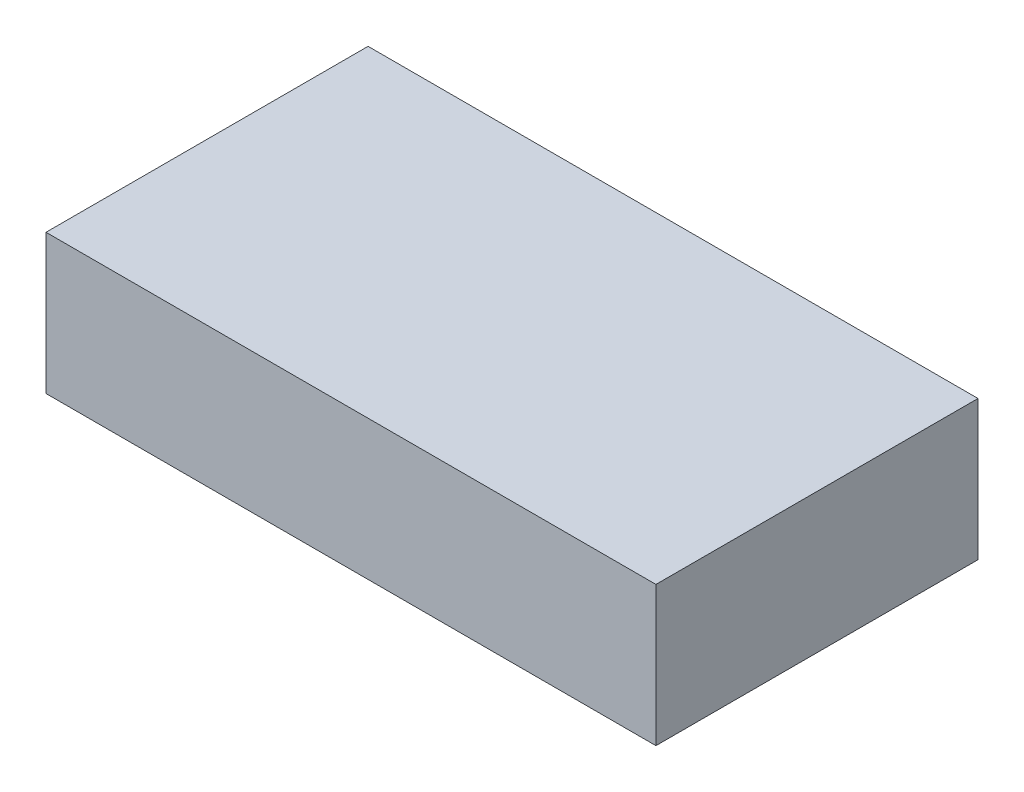
ISO-10303-21;
HEADER;
FILE_DESCRIPTION(('STEP AP214'),'2;1');
FILE_NAME('part.step','',(''),(''),'','','');
FILE_SCHEMA(('AUTOMOTIVE_DESIGN { 1 0 10303 214 1 1 1 1 }'));
ENDSEC;
DATA;
#1=APPLICATION_CONTEXT('core data for automotive mechanical design processes');
#2=APPLICATION_PROTOCOL_DEFINITION('international standard','automotive_design',2000,#1);
#3=PRODUCT_CONTEXT('',#1,'mechanical');
#4=PRODUCT('Part','Part','',(#3));
#5=PRODUCT_RELATED_PRODUCT_CATEGORY('part','',(#4));
#6=PRODUCT_DEFINITION_FORMATION('','',#4);
#7=PRODUCT_DEFINITION_CONTEXT('part definition',#1,'design');
#8=PRODUCT_DEFINITION('design','',#6,#7);
#9=PRODUCT_DEFINITION_SHAPE('','',#8);
#10=(LENGTH_UNIT() NAMED_UNIT(*) SI_UNIT(.MILLI.,.METRE.));
#11=(NAMED_UNIT(*) PLANE_ANGLE_UNIT() SI_UNIT($,.RADIAN.));
#12=(NAMED_UNIT(*) SI_UNIT($,.STERADIAN.) SOLID_ANGLE_UNIT());
#13=UNCERTAINTY_MEASURE_WITH_UNIT(LENGTH_MEASURE(1.E-05),#10,'distance_accuracy_value','');
#14=(GEOMETRIC_REPRESENTATION_CONTEXT(3) GLOBAL_UNCERTAINTY_ASSIGNED_CONTEXT((#13)) GLOBAL_UNIT_ASSIGNED_CONTEXT((#10,
#11,#12)) REPRESENTATION_CONTEXT('',''));
#15=CARTESIAN_POINT('',(0.,0.,0.));
#16=DIRECTION('',(0.,0.,1.));
#17=DIRECTION('',(1.,0.,0.));
#18=AXIS2_PLACEMENT_3D('',#15,#16,#17);
#19=CARTESIAN_POINT('',(0.,49.,0.));
#20=DIRECTION('',(1.,0.,0.));
#21=DIRECTION('',(0.,0.,-1.));
#22=AXIS2_PLACEMENT_3D('',#19,#20,#21);
#23=PLANE('',#22);
#24=DIRECTION('',(0.,0.,1.));
#25=VECTOR('',#24,1.);
#26=CARTESIAN_POINT('',(0.,0.,0.));
#27=LINE('',#26,#25);
#28=CARTESIAN_POINT('',(0.,0.,-113.));
#29=VERTEX_POINT('',#28);
#30=CARTESIAN_POINT('',(0.,0.,0.));
#31=VERTEX_POINT('',#30);
#32=EDGE_CURVE('E97',#29,#31,#27,.T.);
#33=ORIENTED_EDGE('',*,*,#32,.T.);
#34=DIRECTION('',(0.,-1.,0.));
#35=VECTOR('',#34,1.);
#36=CARTESIAN_POINT('',(0.,49.,0.));
#37=LINE('',#36,#35);
#38=CARTESIAN_POINT('',(0.,49.,0.));
#39=VERTEX_POINT('',#38);
#40=EDGE_CURVE('E11',#39,#31,#37,.T.);
#41=ORIENTED_EDGE('',*,*,#40,.F.);
#42=DIRECTION('',(0.,0.,1.));
#43=VECTOR('',#42,1.);
#44=CARTESIAN_POINT('',(0.,49.,0.));
#45=LINE('',#44,#43);
#46=CARTESIAN_POINT('',(0.,49.,-113.));
#47=VERTEX_POINT('',#46);
#48=EDGE_CURVE('E85',#47,#39,#45,.T.);
#49=ORIENTED_EDGE('',*,*,#48,.F.);
#50=DIRECTION('',(0.,-1.,0.));
#51=VECTOR('',#50,1.);
#52=CARTESIAN_POINT('',(0.,49.,-113.));
#53=LINE('',#52,#51);
#54=EDGE_CURVE('E93',#47,#29,#53,.T.);
#55=ORIENTED_EDGE('',*,*,#54,.T.);
#56=EDGE_LOOP('',(#33,#41,#49,#55));
#57=FACE_BOUND('',#56,.T.);
#58=ADVANCED_FACE('F34',(#57),#23,.F.);
#59=CARTESIAN_POINT('',(0.,49.,0.));
#60=DIRECTION('',(0.,0.,-1.));
#61=DIRECTION('',(-1.,0.,0.));
#62=AXIS2_PLACEMENT_3D('',#59,#60,#61);
#63=PLANE('',#62);
#64=DIRECTION('',(1.,0.,0.));
#65=VECTOR('',#64,1.);
#66=CARTESIAN_POINT('',(0.,0.,0.));
#67=LINE('',#66,#65);
#68=CARTESIAN_POINT('',(214.,0.,0.));
#69=VERTEX_POINT('',#68);
#70=EDGE_CURVE('E89',#31,#69,#67,.T.);
#71=ORIENTED_EDGE('',*,*,#70,.T.);
#72=DIRECTION('',(0.,-1.,0.));
#73=VECTOR('',#72,1.);
#74=CARTESIAN_POINT('',(214.,49.,0.));
#75=LINE('',#74,#73);
#76=CARTESIAN_POINT('',(214.,49.,0.));
#77=VERTEX_POINT('',#76);
#78=EDGE_CURVE('E42',#77,#69,#75,.T.);
#79=ORIENTED_EDGE('',*,*,#78,.F.);
#80=DIRECTION('',(1.,0.,0.));
#81=VECTOR('',#80,1.);
#82=CARTESIAN_POINT('',(0.,49.,0.));
#83=LINE('',#82,#81);
#84=EDGE_CURVE('E80',#39,#77,#83,.T.);
#85=ORIENTED_EDGE('',*,*,#84,.F.);
#86=ORIENTED_EDGE('',*,*,#40,.T.);
#87=EDGE_LOOP('',(#71,#79,#85,#86));
#88=FACE_BOUND('',#87,.T.);
#89=ADVANCED_FACE('F88',(#88),#63,.F.);
#90=CARTESIAN_POINT('',(214.,49.,0.));
#91=DIRECTION('',(-1.,0.,0.));
#92=DIRECTION('',(0.,0.,1.));
#93=AXIS2_PLACEMENT_3D('',#90,#91,#92);
#94=PLANE('',#93);
#95=DIRECTION('',(0.,0.,-1.));
#96=VECTOR('',#95,1.);
#97=CARTESIAN_POINT('',(214.,0.,0.));
#98=LINE('',#97,#96);
#99=CARTESIAN_POINT('',(214.,0.,-113.));
#100=VERTEX_POINT('',#99);
#101=EDGE_CURVE('E67',#69,#100,#98,.T.);
#102=ORIENTED_EDGE('',*,*,#101,.T.);
#103=DIRECTION('',(0.,-1.,0.));
#104=VECTOR('',#103,1.);
#105=CARTESIAN_POINT('',(214.,49.,-113.));
#106=LINE('',#105,#104);
#107=CARTESIAN_POINT('',(214.,49.,-113.));
#108=VERTEX_POINT('',#107);
#109=EDGE_CURVE('E90',#108,#100,#106,.T.);
#110=ORIENTED_EDGE('',*,*,#109,.F.);
#111=DIRECTION('',(0.,0.,-1.));
#112=VECTOR('',#111,1.);
#113=CARTESIAN_POINT('',(214.,49.,0.));
#114=LINE('',#113,#112);
#115=EDGE_CURVE('E83',#77,#108,#114,.T.);
#116=ORIENTED_EDGE('',*,*,#115,.F.);
#117=ORIENTED_EDGE('',*,*,#78,.T.);
#118=EDGE_LOOP('',(#102,#110,#116,#117));
#119=FACE_BOUND('',#118,.T.);
#120=ADVANCED_FACE('F91',(#119),#94,.F.);
#121=CARTESIAN_POINT('',(0.,49.,-113.));
#122=DIRECTION('',(0.,0.,1.));
#123=DIRECTION('',(1.,0.,0.));
#124=AXIS2_PLACEMENT_3D('',#121,#122,#123);
#125=PLANE('',#124);
#126=DIRECTION('',(-1.,0.,0.));
#127=VECTOR('',#126,1.);
#128=CARTESIAN_POINT('',(0.,0.,-113.));
#129=LINE('',#128,#127);
#130=EDGE_CURVE('E73',#100,#29,#129,.T.);
#131=ORIENTED_EDGE('',*,*,#130,.T.);
#132=ORIENTED_EDGE('',*,*,#54,.F.);
#133=DIRECTION('',(-1.,0.,0.));
#134=VECTOR('',#133,1.);
#135=CARTESIAN_POINT('',(0.,49.,-113.));
#136=LINE('',#135,#134);
#137=EDGE_CURVE('E50',#108,#47,#136,.T.);
#138=ORIENTED_EDGE('',*,*,#137,.F.);
#139=ORIENTED_EDGE('',*,*,#109,.T.);
#140=EDGE_LOOP('',(#131,#132,#138,#139));
#141=FACE_BOUND('',#140,.T.);
#142=ADVANCED_FACE('F104',(#141),#125,.F.);
#143=CARTESIAN_POINT('',(0.,49.,0.));
#144=DIRECTION('',(0.,-1.,0.));
#145=DIRECTION('',(0.,0.,-1.));
#146=AXIS2_PLACEMENT_3D('',#143,#144,#145);
#147=PLANE('',#146);
#148=ORIENTED_EDGE('',*,*,#48,.T.);
#149=ORIENTED_EDGE('',*,*,#84,.T.);
#150=ORIENTED_EDGE('',*,*,#115,.T.);
#151=ORIENTED_EDGE('',*,*,#137,.T.);
#152=EDGE_LOOP('',(#148,#149,#150,#151));
#153=FACE_BOUND('',#152,.T.);
#154=ADVANCED_FACE('F81',(#153),#147,.F.);
#155=CARTESIAN_POINT('',(0.,0.,0.));
#156=DIRECTION('',(0.,-1.,0.));
#157=DIRECTION('',(0.,0.,-1.));
#158=AXIS2_PLACEMENT_3D('',#155,#156,#157);
#159=PLANE('',#158);
#160=ORIENTED_EDGE('',*,*,#32,.F.);
#161=ORIENTED_EDGE('',*,*,#130,.F.);
#162=ORIENTED_EDGE('',*,*,#101,.F.);
#163=ORIENTED_EDGE('',*,*,#70,.F.);
#164=EDGE_LOOP('',(#160,#161,#162,#163));
#165=FACE_BOUND('',#164,.T.);
#166=ADVANCED_FACE('F107',(#165),#159,.T.);
#167=CLOSED_SHELL('',(#58,#89,#120,#142,#154,#166));
#168=MANIFOLD_SOLID_BREP('B2',#167);
#169=ADVANCED_BREP_SHAPE_REPRESENTATION('',(#18,#168),#14);
#170=SHAPE_DEFINITION_REPRESENTATION(#9,#169);
ENDSEC;
END-ISO-10303-21;
